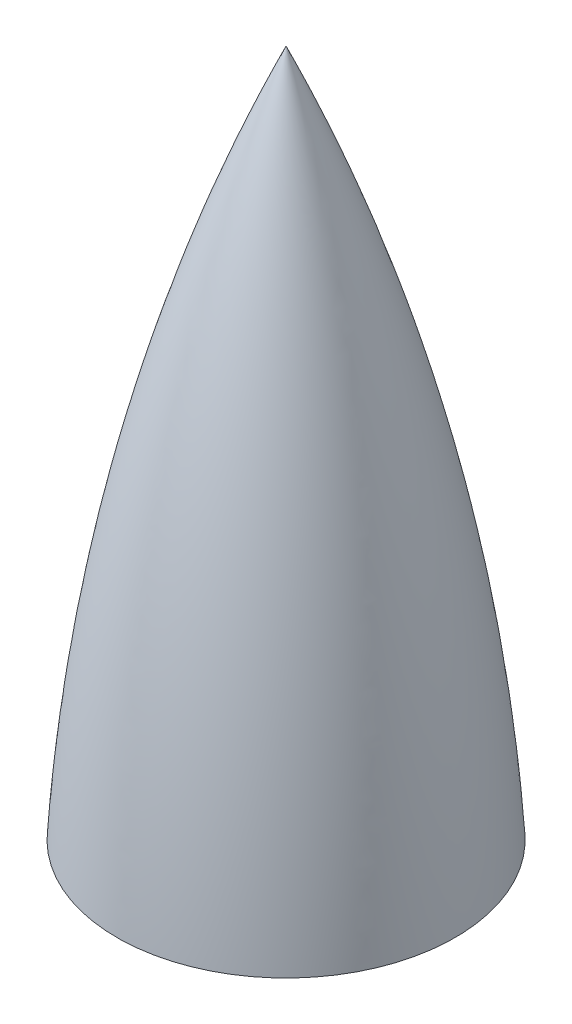
ISO-10303-21;
HEADER;
FILE_DESCRIPTION(('STEP AP214'),'2;1');
FILE_NAME('part.step','',(''),(''),'','','');
FILE_SCHEMA(('AUTOMOTIVE_DESIGN { 1 0 10303 214 1 1 1 1 }'));
ENDSEC;
DATA;
#1=APPLICATION_CONTEXT('core data for automotive mechanical design processes');
#2=APPLICATION_PROTOCOL_DEFINITION('international standard','automotive_design',2000,#1);
#3=PRODUCT_CONTEXT('',#1,'mechanical');
#4=PRODUCT('Part','Part','',(#3));
#5=PRODUCT_RELATED_PRODUCT_CATEGORY('part','',(#4));
#6=PRODUCT_DEFINITION_FORMATION('','',#4);
#7=PRODUCT_DEFINITION_CONTEXT('part definition',#1,'design');
#8=PRODUCT_DEFINITION('design','',#6,#7);
#9=PRODUCT_DEFINITION_SHAPE('','',#8);
#10=(LENGTH_UNIT() NAMED_UNIT(*) SI_UNIT(.MILLI.,.METRE.));
#11=(NAMED_UNIT(*) PLANE_ANGLE_UNIT() SI_UNIT($,.RADIAN.));
#12=(NAMED_UNIT(*) SI_UNIT($,.STERADIAN.) SOLID_ANGLE_UNIT());
#13=UNCERTAINTY_MEASURE_WITH_UNIT(LENGTH_MEASURE(1.E-05),#10,'distance_accuracy_value','');
#14=(GEOMETRIC_REPRESENTATION_CONTEXT(3) GLOBAL_UNCERTAINTY_ASSIGNED_CONTEXT((#13)) GLOBAL_UNIT_ASSIGNED_CONTEXT((#10,
#11,#12)) REPRESENTATION_CONTEXT('',''));
#15=CARTESIAN_POINT('',(0.,0.,0.));
#16=DIRECTION('',(0.,0.,1.));
#17=DIRECTION('',(1.,0.,0.));
#18=AXIS2_PLACEMENT_3D('',#15,#16,#17);
#19=CARTESIAN_POINT('',(997.687666159955,-66.2775668893222,0.));
#20=DIRECTION('',(0.,0.,-1.));
#21=DIRECTION('',(-1.,0.,0.));
#22=AXIS2_PLACEMENT_3D('',#19,#20,#21);
#23=CIRCLE('',#22,1093.36082838655);
#24=TRIMMED_CURVE('',#23,(PARAMETER_VALUE(-0.421451145245718)),
(PARAMETER_VALUE(0.421451145245718)),.T.,.PARAMETER.);
#25=CARTESIAN_POINT('',(-7.7715611723761E-13,-66.2775668893205,0.));
#26=DIRECTION('',(0.,1.,0.));
#27=AXIS1_PLACEMENT('',#25,#26);
#28=SURFACE_OF_REVOLUTION('',#24,#27);
#29=CARTESIAN_POINT('',(-6.53226602665202E-13,-1.66533453693773E-13,0.));
#30=DIRECTION('',(0.,1.,0.));
#31=DIRECTION('',(-1.,0.,0.));
#32=AXIS2_PLACEMENT_3D('',#29,#30,#31);
#33=CIRCLE('',#32,93.6624999999993);
#34=CARTESIAN_POINT('',(-93.6625,0.,0.));
#35=VERTEX_POINT('',#34);
#36=EDGE_CURVE('E11',#35,#35,#33,.T.);
#37=ORIENTED_EDGE('',*,*,#36,.T.);
#38=EDGE_LOOP('',(#37));
#39=FACE_BOUND('',#38,.T.);
#40=CARTESIAN_POINT('',(0.,381.,0.));
#41=VERTEX_POINT('',#40);
#42=VERTEX_LOOP('',#41);
#43=FACE_BOUND('',#42,.T.);
#44=ADVANCED_FACE('F41',(#39,#43),#28,.T.);
#45=CARTESIAN_POINT('',(-93.6625,-1.2775631790758E-13,0.));
#46=DIRECTION('',(0.,-1.,0.));
#47=DIRECTION('',(1.,0.,0.));
#48=AXIS2_PLACEMENT_3D('',#45,#46,#47);
#49=PLANE('',#48);
#50=CARTESIAN_POINT('',(-6.53226602665202E-13,-4.44089209850063E-13,0.));
#51=DIRECTION('',(0.,1.,0.));
#52=DIRECTION('',(-1.,0.,0.));
#53=AXIS2_PLACEMENT_3D('',#50,#51,#52);
#54=CIRCLE('',#53,88.8999999999993);
#55=CARTESIAN_POINT('',(-88.9,-2.91669669228183E-13,0.));
#56=VERTEX_POINT('',#55);
#57=EDGE_CURVE('E49',#56,#56,#54,.T.);
#58=ORIENTED_EDGE('',*,*,#57,.T.);
#59=EDGE_LOOP('',(#58));
#60=FACE_BOUND('',#59,.T.);
#61=ORIENTED_EDGE('',*,*,#36,.F.);
#62=EDGE_LOOP('',(#61));
#63=FACE_BOUND('',#62,.T.);
#64=ADVANCED_FACE('F58',(#60,#63),#49,.T.);
#65=CARTESIAN_POINT('',(1114.6957846476,-86.1623139369334,0.));
#66=DIRECTION('',(0.,0.,-1.));
#67=DIRECTION('',(-1.,0.,0.));
#68=AXIS2_PLACEMENT_3D('',#65,#66,#67);
#69=CIRCLE('',#68,1206.67591223346);
#70=TRIMMED_CURVE('',#69,(PARAMETER_VALUE(-0.392974866829419)),
(PARAMETER_VALUE(0.392974866829419)),.T.,.PARAMETER.);
#71=CARTESIAN_POINT('',(-8.88178419700125E-13,-86.1623139369315,0.));
#72=DIRECTION('',(0.,1.,0.));
#73=AXIS1_PLACEMENT('',#71,#72);
#74=SURFACE_OF_REVOLUTION('',#70,#73);
#75=CARTESIAN_POINT('',(0.,375.92,0.));
#76=VERTEX_POINT('',#75);
#77=VERTEX_LOOP('',#76);
#78=FACE_BOUND('',#77,.T.);
#79=ORIENTED_EDGE('',*,*,#57,.F.);
#80=EDGE_LOOP('',(#79));
#81=FACE_BOUND('',#80,.T.);
#82=ADVANCED_FACE('F55',(#78,#81),#74,.F.);
#83=CLOSED_SHELL('',(#44,#64,#82));
#84=MANIFOLD_SOLID_BREP('B2',#83);
#85=ADVANCED_BREP_SHAPE_REPRESENTATION('',(#18,#84),#14);
#86=SHAPE_DEFINITION_REPRESENTATION(#9,#85);
ENDSEC;
END-ISO-10303-21;
